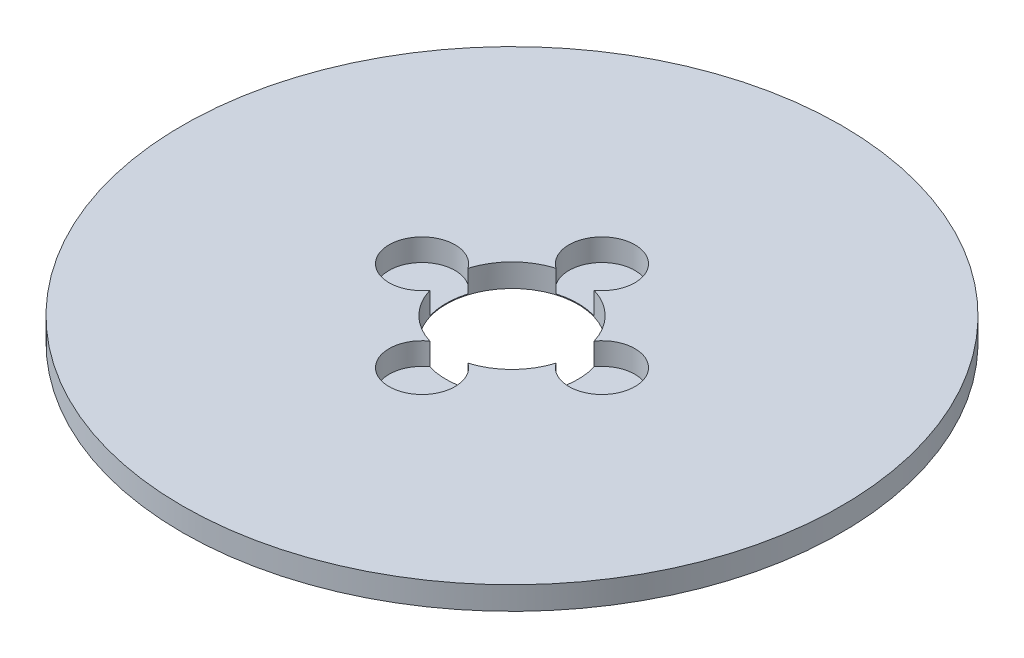
ISO-10303-21;
HEADER;
FILE_DESCRIPTION(('STEP AP214'),'2;1');
FILE_NAME('part.step','',(''),(''),'','','');
FILE_SCHEMA(('AUTOMOTIVE_DESIGN { 1 0 10303 214 1 1 1 1 }'));
ENDSEC;
DATA;
#1=APPLICATION_CONTEXT('core data for automotive mechanical design processes');
#2=APPLICATION_PROTOCOL_DEFINITION('international standard','automotive_design',2000,#1);
#3=PRODUCT_CONTEXT('',#1,'mechanical');
#4=PRODUCT('Part','Part','',(#3));
#5=PRODUCT_RELATED_PRODUCT_CATEGORY('part','',(#4));
#6=PRODUCT_DEFINITION_FORMATION('','',#4);
#7=PRODUCT_DEFINITION_CONTEXT('part definition',#1,'design');
#8=PRODUCT_DEFINITION('design','',#6,#7);
#9=PRODUCT_DEFINITION_SHAPE('','',#8);
#10=(LENGTH_UNIT() NAMED_UNIT(*) SI_UNIT(.MILLI.,.METRE.));
#11=(NAMED_UNIT(*) PLANE_ANGLE_UNIT() SI_UNIT($,.RADIAN.));
#12=(NAMED_UNIT(*) SI_UNIT($,.STERADIAN.) SOLID_ANGLE_UNIT());
#13=UNCERTAINTY_MEASURE_WITH_UNIT(LENGTH_MEASURE(1.E-05),#10,'distance_accuracy_value','');
#14=(GEOMETRIC_REPRESENTATION_CONTEXT(3) GLOBAL_UNCERTAINTY_ASSIGNED_CONTEXT((#13)) GLOBAL_UNIT_ASSIGNED_CONTEXT((#10,
#11,#12)) REPRESENTATION_CONTEXT('',''));
#15=CARTESIAN_POINT('',(0.,0.,0.));
#16=DIRECTION('',(0.,0.,1.));
#17=DIRECTION('',(1.,0.,0.));
#18=AXIS2_PLACEMENT_3D('',#15,#16,#17);
#19=CARTESIAN_POINT('',(0.,7.,0.));
#20=DIRECTION('',(0.,-1.,0.));
#21=DIRECTION('',(0.,0.,-1.));
#22=AXIS2_PLACEMENT_3D('',#19,#20,#21);
#23=CYLINDRICAL_SURFACE('',#22,100.);
#24=CARTESIAN_POINT('',(0.,7.,0.));
#25=DIRECTION('',(0.,1.,0.));
#26=DIRECTION('',(0.,0.,1.));
#27=AXIS2_PLACEMENT_3D('',#24,#25,#26);
#28=CIRCLE('',#27,100.);
#29=CARTESIAN_POINT('',(0.,7.,100.));
#30=VERTEX_POINT('',#29);
#31=EDGE_CURVE('E145',#30,#30,#28,.T.);
#32=ORIENTED_EDGE('',*,*,#31,.F.);
#33=EDGE_LOOP('',(#32));
#34=FACE_BOUND('',#33,.T.);
#35=CARTESIAN_POINT('',(0.,0.,0.));
#36=DIRECTION('',(0.,1.,0.));
#37=DIRECTION('',(0.,0.,1.));
#38=AXIS2_PLACEMENT_3D('',#35,#36,#37);
#39=CIRCLE('',#38,100.);
#40=CARTESIAN_POINT('',(0.,0.,100.));
#41=VERTEX_POINT('',#40);
#42=EDGE_CURVE('E143',#41,#41,#39,.T.);
#43=ORIENTED_EDGE('',*,*,#42,.T.);
#44=EDGE_LOOP('',(#43));
#45=FACE_BOUND('',#44,.T.);
#46=ADVANCED_FACE('F39',(#34,#45),#23,.T.);
#47=CARTESIAN_POINT('',(0.,7.,0.));
#48=DIRECTION('',(0.,1.,0.));
#49=DIRECTION('',(0.,0.,1.));
#50=AXIS2_PLACEMENT_3D('',#47,#48,#49);
#51=PLANE('',#50);
#52=CARTESIAN_POINT('',(0.,7.,27.2907537002926));
#53=DIRECTION('',(0.,1.,0.));
#54=DIRECTION('',(1.,0.,0.));
#55=AXIS2_PLACEMENT_3D('',#52,#53,#54);
#56=CIRCLE('',#55,10.);
#57=CARTESIAN_POINT('',(-5.79600203853387,7.,19.1417439218403));
#58=VERTEX_POINT('',#57);
#59=CARTESIAN_POINT('',(5.79600203853401,7.,19.1417439218403));
#60=VERTEX_POINT('',#59);
#61=EDGE_CURVE('E152',#58,#60,#56,.T.);
#62=ORIENTED_EDGE('',*,*,#61,.F.);
#63=CARTESIAN_POINT('',(0.,7.,0.));
#64=DIRECTION('',(0.,1.,0.));
#65=DIRECTION('',(0.,0.,1.));
#66=AXIS2_PLACEMENT_3D('',#63,#64,#65);
#67=CIRCLE('',#66,20.);
#68=CARTESIAN_POINT('',(-19.1417439218403,7.,5.79600203853394));
#69=VERTEX_POINT('',#68);
#70=EDGE_CURVE('E133',#69,#58,#67,.T.);
#71=ORIENTED_EDGE('',*,*,#70,.F.);
#72=CARTESIAN_POINT('',(-27.2907537002926,7.,0.));
#73=DIRECTION('',(0.,1.,0.));
#74=DIRECTION('',(0.,0.,1.));
#75=AXIS2_PLACEMENT_3D('',#72,#73,#74);
#76=CIRCLE('',#75,10.);
#77=CARTESIAN_POINT('',(-19.1417439218403,7.,-5.79600203853394));
#78=VERTEX_POINT('',#77);
#79=EDGE_CURVE('E128',#78,#69,#76,.T.);
#80=ORIENTED_EDGE('',*,*,#79,.F.);
#81=CARTESIAN_POINT('',(-5.79600203853414,7.,-19.1417439218402));
#82=VERTEX_POINT('',#81);
#83=EDGE_CURVE('E121',#82,#78,#67,.T.);
#84=ORIENTED_EDGE('',*,*,#83,.F.);
#85=CARTESIAN_POINT('',(-2.85855471802607E-13,7.,-27.2907537002926));
#86=DIRECTION('',(0.,1.,0.));
#87=DIRECTION('',(-1.,0.,0.));
#88=AXIS2_PLACEMENT_3D('',#85,#86,#87);
#89=CIRCLE('',#88,10.);
#90=CARTESIAN_POINT('',(5.79600203853374,7.,-19.1417439218404));
#91=VERTEX_POINT('',#90);
#92=EDGE_CURVE('E105',#91,#82,#89,.T.);
#93=ORIENTED_EDGE('',*,*,#92,.F.);
#94=CARTESIAN_POINT('',(19.1417439218403,7.,-5.79600203853394));
#95=VERTEX_POINT('',#94);
#96=EDGE_CURVE('E131',#95,#91,#67,.T.);
#97=ORIENTED_EDGE('',*,*,#96,.F.);
#98=CARTESIAN_POINT('',(27.2907537002926,7.,0.));
#99=DIRECTION('',(0.,1.,0.));
#100=DIRECTION('',(0.,0.,-1.));
#101=AXIS2_PLACEMENT_3D('',#98,#99,#100);
#102=CIRCLE('',#101,10.);
#103=CARTESIAN_POINT('',(19.1417439218403,7.,5.79600203853394));
#104=VERTEX_POINT('',#103);
#105=EDGE_CURVE('E154',#104,#95,#102,.T.);
#106=ORIENTED_EDGE('',*,*,#105,.F.);
#107=EDGE_CURVE('E134',#60,#104,#67,.T.);
#108=ORIENTED_EDGE('',*,*,#107,.F.);
#109=EDGE_LOOP('',(#62,#71,#80,#84,#93,#97,#106,#108));
#110=FACE_BOUND('',#109,.T.);
#111=ORIENTED_EDGE('',*,*,#31,.T.);
#112=EDGE_LOOP('',(#111));
#113=FACE_BOUND('',#112,.T.);
#114=ADVANCED_FACE('F130',(#110,#113),#51,.T.);
#115=CARTESIAN_POINT('',(0.,0.,0.));
#116=DIRECTION('',(0.,1.,0.));
#117=DIRECTION('',(0.,0.,1.));
#118=AXIS2_PLACEMENT_3D('',#115,#116,#117);
#119=PLANE('',#118);
#120=CARTESIAN_POINT('',(0.,0.,0.));
#121=DIRECTION('',(0.,1.,0.));
#122=DIRECTION('',(0.,0.,1.));
#123=AXIS2_PLACEMENT_3D('',#120,#121,#122);
#124=CIRCLE('',#123,20.);
#125=CARTESIAN_POINT('',(0.,0.,20.));
#126=VERTEX_POINT('',#125);
#127=EDGE_CURVE('E135',#126,#126,#124,.T.);
#128=ORIENTED_EDGE('',*,*,#127,.T.);
#129=EDGE_LOOP('',(#128));
#130=FACE_BOUND('',#129,.T.);
#131=ORIENTED_EDGE('',*,*,#42,.F.);
#132=EDGE_LOOP('',(#131));
#133=FACE_BOUND('',#132,.T.);
#134=ADVANCED_FACE('F195',(#130,#133),#119,.F.);
#135=CARTESIAN_POINT('',(0.,7.,0.));
#136=DIRECTION('',(0.,-1.,0.));
#137=DIRECTION('',(0.,0.,-1.));
#138=AXIS2_PLACEMENT_3D('',#135,#136,#137);
#139=CYLINDRICAL_SURFACE('',#138,20.);
#140=DIRECTION('',(0.,1.,0.));
#141=VECTOR('',#140,1.);
#142=CARTESIAN_POINT('',(-5.79600203853387,3.62657406803156,19.1417439218403));
#143=LINE('',#142,#141);
#144=CARTESIAN_POINT('',(-5.79600203853387,0.253148136063122,19.1417439218403));
#145=VERTEX_POINT('',#144);
#146=EDGE_CURVE('E11',#145,#58,#143,.T.);
#147=ORIENTED_EDGE('',*,*,#146,.F.);
#148=CARTESIAN_POINT('',(0.,0.253148136063122,0.));
#149=DIRECTION('',(0.,1.,0.));
#150=DIRECTION('',(0.,0.,1.));
#151=AXIS2_PLACEMENT_3D('',#148,#149,#150);
#152=CIRCLE('',#151,20.);
#153=CARTESIAN_POINT('',(5.79600203853401,0.253148136063122,19.1417439218403));
#154=VERTEX_POINT('',#153);
#155=EDGE_CURVE('E169',#145,#154,#152,.T.);
#156=ORIENTED_EDGE('',*,*,#155,.T.);
#157=DIRECTION('',(0.,1.,0.));
#158=VECTOR('',#157,1.);
#159=CARTESIAN_POINT('',(5.79600203853401,3.62657406803156,19.1417439218403));
#160=LINE('',#159,#158);
#161=EDGE_CURVE('E46',#60,#154,#160,.F.);
#162=ORIENTED_EDGE('',*,*,#161,.F.);
#163=ORIENTED_EDGE('',*,*,#107,.T.);
#164=DIRECTION('',(0.,1.,0.));
#165=VECTOR('',#164,1.);
#166=CARTESIAN_POINT('',(19.1417439218403,3.62657406803156,5.79600203853394));
#167=LINE('',#166,#165);
#168=CARTESIAN_POINT('',(19.1417439218403,0.253148136063122,5.79600203853394));
#169=VERTEX_POINT('',#168);
#170=EDGE_CURVE('E151',#169,#104,#167,.T.);
#171=ORIENTED_EDGE('',*,*,#170,.F.);
#172=CARTESIAN_POINT('',(0.,0.253148136063122,0.));
#173=DIRECTION('',(0.,1.,0.));
#174=DIRECTION('',(0.,0.,1.));
#175=AXIS2_PLACEMENT_3D('',#172,#173,#174);
#176=CIRCLE('',#175,20.);
#177=CARTESIAN_POINT('',(19.1417439218403,0.253148136063122,-5.79600203853394));
#178=VERTEX_POINT('',#177);
#179=EDGE_CURVE('E173',#169,#178,#176,.T.);
#180=ORIENTED_EDGE('',*,*,#179,.T.);
#181=DIRECTION('',(0.,1.,0.));
#182=VECTOR('',#181,1.);
#183=CARTESIAN_POINT('',(19.1417439218403,3.62657406803156,-5.79600203853394));
#184=LINE('',#183,#182);
#185=EDGE_CURVE('E168',#95,#178,#184,.F.);
#186=ORIENTED_EDGE('',*,*,#185,.F.);
#187=ORIENTED_EDGE('',*,*,#96,.T.);
#188=DIRECTION('',(0.,1.,0.));
#189=VECTOR('',#188,1.);
#190=CARTESIAN_POINT('',(5.79600203853374,3.62657406803156,-19.1417439218404));
#191=LINE('',#190,#189);
#192=CARTESIAN_POINT('',(5.79600203853374,0.253148136063122,-19.1417439218404));
#193=VERTEX_POINT('',#192);
#194=EDGE_CURVE('E108',#193,#91,#191,.T.);
#195=ORIENTED_EDGE('',*,*,#194,.F.);
#196=CARTESIAN_POINT('',(0.,0.253148136063122,0.));
#197=DIRECTION('',(0.,1.,0.));
#198=DIRECTION('',(0.,0.,1.));
#199=AXIS2_PLACEMENT_3D('',#196,#197,#198);
#200=CIRCLE('',#199,20.);
#201=CARTESIAN_POINT('',(-5.79600203853414,0.253148136063122,-19.1417439218402));
#202=VERTEX_POINT('',#201);
#203=EDGE_CURVE('E122',#193,#202,#200,.T.);
#204=ORIENTED_EDGE('',*,*,#203,.T.);
#205=DIRECTION('',(0.,1.,0.));
#206=VECTOR('',#205,1.);
#207=CARTESIAN_POINT('',(-5.79600203853414,3.62657406803156,-19.1417439218402));
#208=LINE('',#207,#206);
#209=EDGE_CURVE('E106',#82,#202,#208,.F.);
#210=ORIENTED_EDGE('',*,*,#209,.F.);
#211=ORIENTED_EDGE('',*,*,#83,.T.);
#212=DIRECTION('',(0.,1.,0.));
#213=VECTOR('',#212,1.);
#214=CARTESIAN_POINT('',(-19.1417439218403,3.62657406803156,-5.79600203853394));
#215=LINE('',#214,#213);
#216=CARTESIAN_POINT('',(-19.1417439218403,0.253148136063122,-5.79600203853394));
#217=VERTEX_POINT('',#216);
#218=EDGE_CURVE('E177',#217,#78,#215,.T.);
#219=ORIENTED_EDGE('',*,*,#218,.F.);
#220=CARTESIAN_POINT('',(0.,0.253148136063122,0.));
#221=DIRECTION('',(0.,1.,0.));
#222=DIRECTION('',(0.,0.,1.));
#223=AXIS2_PLACEMENT_3D('',#220,#221,#222);
#224=CIRCLE('',#223,20.);
#225=CARTESIAN_POINT('',(-19.1417439218403,0.253148136063122,5.79600203853394));
#226=VERTEX_POINT('',#225);
#227=EDGE_CURVE('E185',#217,#226,#224,.T.);
#228=ORIENTED_EDGE('',*,*,#227,.T.);
#229=DIRECTION('',(0.,1.,0.));
#230=VECTOR('',#229,1.);
#231=CARTESIAN_POINT('',(-19.1417439218403,3.62657406803156,5.79600203853394));
#232=LINE('',#231,#230);
#233=EDGE_CURVE('E179',#69,#226,#232,.F.);
#234=ORIENTED_EDGE('',*,*,#233,.F.);
#235=ORIENTED_EDGE('',*,*,#70,.T.);
#236=EDGE_LOOP('',(#147,#156,#162,#163,#171,#180,#186,#187,#195,#204,#210,#211,#219,#228,#234,#235));
#237=FACE_BOUND('',#236,.T.);
#238=ORIENTED_EDGE('',*,*,#127,.F.);
#239=EDGE_LOOP('',(#238));
#240=FACE_BOUND('',#239,.T.);
#241=ADVANCED_FACE('F117',(#237,#240),#139,.F.);
#242=CARTESIAN_POINT('',(-27.2907537002926,0.253148136063122,0.));
#243=DIRECTION('',(0.,1.,0.));
#244=DIRECTION('',(0.,0.,1.));
#245=AXIS2_PLACEMENT_3D('',#242,#243,#244);
#246=CYLINDRICAL_SURFACE('',#245,10.);
#247=ORIENTED_EDGE('',*,*,#218,.T.);
#248=ORIENTED_EDGE('',*,*,#79,.T.);
#249=ORIENTED_EDGE('',*,*,#233,.T.);
#250=CARTESIAN_POINT('',(-27.2907537002926,0.253148136063122,0.));
#251=DIRECTION('',(0.,1.,0.));
#252=DIRECTION('',(0.,0.,1.));
#253=AXIS2_PLACEMENT_3D('',#250,#251,#252);
#254=CIRCLE('',#253,10.);
#255=EDGE_CURVE('E140',#217,#226,#254,.T.);
#256=ORIENTED_EDGE('',*,*,#255,.F.);
#257=EDGE_LOOP('',(#247,#248,#249,#256));
#258=FACE_BOUND('',#257,.T.);
#259=ADVANCED_FACE('F200',(#258),#246,.F.);
#260=CARTESIAN_POINT('',(-27.2907537002926,0.253148136063122,0.));
#261=DIRECTION('',(0.,1.,0.));
#262=DIRECTION('',(0.,0.,1.));
#263=AXIS2_PLACEMENT_3D('',#260,#261,#262);
#264=PLANE('',#263);
#265=ORIENTED_EDGE('',*,*,#255,.T.);
#266=ORIENTED_EDGE('',*,*,#227,.F.);
#267=EDGE_LOOP('',(#265,#266));
#268=FACE_BOUND('',#267,.T.);
#269=ADVANCED_FACE('F202',(#268),#264,.T.);
#270=CARTESIAN_POINT('',(-2.85855471802607E-13,0.253148136063122,-27.2907537002926));
#271=DIRECTION('',(0.,1.,0.));
#272=DIRECTION('',(0.,0.,1.));
#273=AXIS2_PLACEMENT_3D('',#270,#271,#272);
#274=CYLINDRICAL_SURFACE('',#273,10.);
#275=ORIENTED_EDGE('',*,*,#194,.T.);
#276=ORIENTED_EDGE('',*,*,#92,.T.);
#277=ORIENTED_EDGE('',*,*,#209,.T.);
#278=CARTESIAN_POINT('',(-2.85855471802607E-13,0.253148136063122,-27.2907537002926));
#279=DIRECTION('',(0.,1.,0.));
#280=DIRECTION('',(-1.,0.,0.));
#281=AXIS2_PLACEMENT_3D('',#278,#279,#280);
#282=CIRCLE('',#281,10.);
#283=EDGE_CURVE('E111',#193,#202,#282,.T.);
#284=ORIENTED_EDGE('',*,*,#283,.F.);
#285=EDGE_LOOP('',(#275,#276,#277,#284));
#286=FACE_BOUND('',#285,.T.);
#287=ADVANCED_FACE('F102',(#286),#274,.F.);
#288=CARTESIAN_POINT('',(-2.85855471802607E-13,0.253148136063122,-27.2907537002926));
#289=DIRECTION('',(0.,1.,0.));
#290=DIRECTION('',(-1.,0.,0.));
#291=AXIS2_PLACEMENT_3D('',#288,#289,#290);
#292=PLANE('',#291);
#293=ORIENTED_EDGE('',*,*,#283,.T.);
#294=ORIENTED_EDGE('',*,*,#203,.F.);
#295=EDGE_LOOP('',(#293,#294));
#296=FACE_BOUND('',#295,.T.);
#297=ADVANCED_FACE('F211',(#296),#292,.T.);
#298=CARTESIAN_POINT('',(27.2907537002926,0.253148136063122,0.));
#299=DIRECTION('',(0.,1.,0.));
#300=DIRECTION('',(0.,0.,1.));
#301=AXIS2_PLACEMENT_3D('',#298,#299,#300);
#302=CYLINDRICAL_SURFACE('',#301,10.);
#303=ORIENTED_EDGE('',*,*,#170,.T.);
#304=ORIENTED_EDGE('',*,*,#105,.T.);
#305=ORIENTED_EDGE('',*,*,#185,.T.);
#306=CARTESIAN_POINT('',(27.2907537002926,0.253148136063122,0.));
#307=DIRECTION('',(0.,1.,0.));
#308=DIRECTION('',(0.,0.,-1.));
#309=AXIS2_PLACEMENT_3D('',#306,#307,#308);
#310=CIRCLE('',#309,10.);
#311=EDGE_CURVE('E56',#169,#178,#310,.T.);
#312=ORIENTED_EDGE('',*,*,#311,.F.);
#313=EDGE_LOOP('',(#303,#304,#305,#312));
#314=FACE_BOUND('',#313,.T.);
#315=ADVANCED_FACE('F212',(#314),#302,.F.);
#316=CARTESIAN_POINT('',(27.2907537002926,0.253148136063122,0.));
#317=DIRECTION('',(0.,1.,0.));
#318=DIRECTION('',(0.,0.,-1.));
#319=AXIS2_PLACEMENT_3D('',#316,#317,#318);
#320=PLANE('',#319);
#321=ORIENTED_EDGE('',*,*,#311,.T.);
#322=ORIENTED_EDGE('',*,*,#179,.F.);
#323=EDGE_LOOP('',(#321,#322));
#324=FACE_BOUND('',#323,.T.);
#325=ADVANCED_FACE('F217',(#324),#320,.T.);
#326=CARTESIAN_POINT('',(0.,0.253148136063122,27.2907537002926));
#327=DIRECTION('',(0.,1.,0.));
#328=DIRECTION('',(0.,0.,1.));
#329=AXIS2_PLACEMENT_3D('',#326,#327,#328);
#330=CYLINDRICAL_SURFACE('',#329,10.);
#331=ORIENTED_EDGE('',*,*,#146,.T.);
#332=ORIENTED_EDGE('',*,*,#61,.T.);
#333=ORIENTED_EDGE('',*,*,#161,.T.);
#334=CARTESIAN_POINT('',(0.,0.253148136063122,27.2907537002926));
#335=DIRECTION('',(0.,1.,0.));
#336=DIRECTION('',(1.,0.,0.));
#337=AXIS2_PLACEMENT_3D('',#334,#335,#336);
#338=CIRCLE('',#337,10.);
#339=EDGE_CURVE('E55',#145,#154,#338,.T.);
#340=ORIENTED_EDGE('',*,*,#339,.F.);
#341=EDGE_LOOP('',(#331,#332,#333,#340));
#342=FACE_BOUND('',#341,.T.);
#343=ADVANCED_FACE('F170',(#342),#330,.F.);
#344=CARTESIAN_POINT('',(0.,0.253148136063122,27.2907537002926));
#345=DIRECTION('',(0.,1.,0.));
#346=DIRECTION('',(1.,0.,0.));
#347=AXIS2_PLACEMENT_3D('',#344,#345,#346);
#348=PLANE('',#347);
#349=ORIENTED_EDGE('',*,*,#339,.T.);
#350=ORIENTED_EDGE('',*,*,#155,.F.);
#351=EDGE_LOOP('',(#349,#350));
#352=FACE_BOUND('',#351,.T.);
#353=ADVANCED_FACE('F224',(#352),#348,.T.);
#354=CLOSED_SHELL('',(#46,#114,#134,#241,#259,#269,#287,#297,#315,#325,#343,#353));
#355=MANIFOLD_SOLID_BREP('B2',#354);
#356=ADVANCED_BREP_SHAPE_REPRESENTATION('',(#18,#355),#14);
#357=SHAPE_DEFINITION_REPRESENTATION(#9,#356);
ENDSEC;
END-ISO-10303-21;
